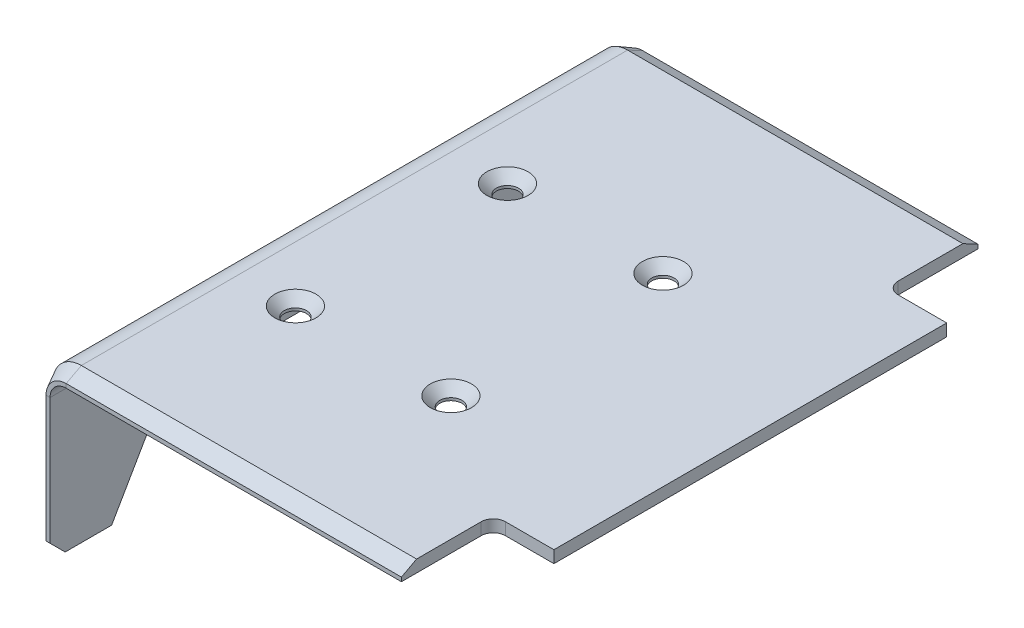
ISO-10303-21;
HEADER;
FILE_DESCRIPTION(('STEP AP214'),'2;1');
FILE_NAME('part.step','',(''),(''),'','','');
FILE_SCHEMA(('AUTOMOTIVE_DESIGN { 1 0 10303 214 1 1 1 1 }'));
ENDSEC;
DATA;
#1=APPLICATION_CONTEXT('core data for automotive mechanical design processes');
#2=APPLICATION_PROTOCOL_DEFINITION('international standard','automotive_design',2000,#1);
#3=PRODUCT_CONTEXT('',#1,'mechanical');
#4=PRODUCT('Part','Part','',(#3));
#5=PRODUCT_RELATED_PRODUCT_CATEGORY('part','',(#4));
#6=PRODUCT_DEFINITION_FORMATION('','',#4);
#7=PRODUCT_DEFINITION_CONTEXT('part definition',#1,'design');
#8=PRODUCT_DEFINITION('design','',#6,#7);
#9=PRODUCT_DEFINITION_SHAPE('','',#8);
#10=(LENGTH_UNIT() NAMED_UNIT(*) SI_UNIT(.MILLI.,.METRE.));
#11=(NAMED_UNIT(*) PLANE_ANGLE_UNIT() SI_UNIT($,.RADIAN.));
#12=(NAMED_UNIT(*) SI_UNIT($,.STERADIAN.) SOLID_ANGLE_UNIT());
#13=UNCERTAINTY_MEASURE_WITH_UNIT(LENGTH_MEASURE(1.E-05),#10,'distance_accuracy_value','');
#14=(GEOMETRIC_REPRESENTATION_CONTEXT(3) GLOBAL_UNCERTAINTY_ASSIGNED_CONTEXT((#13)) GLOBAL_UNIT_ASSIGNED_CONTEXT((#10,
#11,#12)) REPRESENTATION_CONTEXT('',''));
#15=CARTESIAN_POINT('',(0.,0.,0.));
#16=DIRECTION('',(0.,0.,1.));
#17=DIRECTION('',(1.,0.,0.));
#18=AXIS2_PLACEMENT_3D('',#15,#16,#17);
#19=CARTESIAN_POINT('',(-91.,70.,142.75));
#20=DIRECTION('',(0.,0.,-1.));
#21=DIRECTION('',(-1.,0.,0.));
#22=AXIS2_PLACEMENT_3D('',#19,#20,#21);
#23=CYLINDRICAL_SURFACE('',#22,14.);
#24=DIRECTION('',(0.,0.,-1.));
#25=VECTOR('',#24,1.);
#26=CARTESIAN_POINT('',(-91.,84.,142.75));
#27=LINE('',#26,#25);
#28=CARTESIAN_POINT('',(-90.9999999999998,84.,135.25));
#29=VERTEX_POINT('',#28);
#30=CARTESIAN_POINT('',(-90.9999999999998,84.,-135.25));
#31=VERTEX_POINT('',#30);
#32=EDGE_CURVE('E231',#29,#31,#27,.T.);
#33=ORIENTED_EDGE('',*,*,#32,.T.);
#34=CARTESIAN_POINT('',(-91.,70.,-135.25));
#35=DIRECTION('',(0.,0.,1.));
#36=DIRECTION('',(1.,0.,0.));
#37=AXIS2_PLACEMENT_3D('',#34,#35,#36);
#38=CIRCLE('',#37,14.);
#39=CARTESIAN_POINT('',(-105.,70.0000000000001,-135.25));
#40=VERTEX_POINT('',#39);
#41=EDGE_CURVE('E576',#31,#40,#38,.T.);
#42=ORIENTED_EDGE('',*,*,#41,.T.);
#43=DIRECTION('',(0.,0.,-1.));
#44=VECTOR('',#43,1.);
#45=CARTESIAN_POINT('',(-105.,69.9999999999999,142.75));
#46=LINE('',#45,#44);
#47=CARTESIAN_POINT('',(-105.,70.0000000000001,135.25));
#48=VERTEX_POINT('',#47);
#49=EDGE_CURVE('E238',#48,#40,#46,.T.);
#50=ORIENTED_EDGE('',*,*,#49,.F.);
#51=CARTESIAN_POINT('',(-91.,70.,135.25));
#52=DIRECTION('',(0.,0.,1.));
#53=DIRECTION('',(1.,0.,0.));
#54=AXIS2_PLACEMENT_3D('',#51,#52,#53);
#55=CIRCLE('',#54,14.);
#56=EDGE_CURVE('E473',#29,#48,#55,.T.);
#57=ORIENTED_EDGE('',*,*,#56,.F.);
#58=EDGE_LOOP('',(#33,#42,#50,#57));
#59=FACE_BOUND('',#58,.T.);
#60=ADVANCED_FACE('F36',(#59),#23,.T.);
#61=CARTESIAN_POINT('',(-105.,0.,142.75));
#62=DIRECTION('',(-1.,0.,0.));
#63=DIRECTION('',(0.,-1.,0.));
#64=AXIS2_PLACEMENT_3D('',#61,#62,#63);
#65=PLANE('',#64);
#66=DIRECTION('',(0.,-1.,0.));
#67=VECTOR('',#66,1.);
#68=CARTESIAN_POINT('',(-105.,70.0000000000001,-135.25));
#69=LINE('',#68,#67);
#70=CARTESIAN_POINT('',(-105.,-2.50000000000083,-135.25));
#71=VERTEX_POINT('',#70);
#72=EDGE_CURVE('E335',#40,#71,#69,.T.);
#73=ORIENTED_EDGE('',*,*,#72,.T.);
#74=DIRECTION('',(0.,0.,1.));
#75=VECTOR('',#74,1.);
#76=CARTESIAN_POINT('',(-105.,-2.5,-142.75));
#77=LINE('',#76,#75);
#78=CARTESIAN_POINT('',(-105.,-2.5,-104.193375672974));
#79=VERTEX_POINT('',#78);
#80=EDGE_CURVE('E276',#71,#79,#77,.T.);
#81=ORIENTED_EDGE('',*,*,#80,.T.);
#82=DIRECTION('',(0.,-0.866025403784436,-0.500000000000004));
#83=VECTOR('',#82,1.);
#84=CARTESIAN_POINT('',(-105.,0.,-102.75));
#85=LINE('',#84,#83);
#86=CARTESIAN_POINT('',(-105.,35.0000000000001,-82.5427405783628));
#87=VERTEX_POINT('',#86);
#88=EDGE_CURVE('E401',#87,#79,#85,.T.);
#89=ORIENTED_EDGE('',*,*,#88,.F.);
#90=CARTESIAN_POINT('',(-105.,25.,-65.2222325026741));
#91=DIRECTION('',(-1.,0.,0.));
#92=DIRECTION('',(0.,0.,-1.));
#93=AXIS2_PLACEMENT_3D('',#90,#91,#92);
#94=CIRCLE('',#93,20.);
#95=CARTESIAN_POINT('',(-105.,45.,-65.2222325026741));
#96=VERTEX_POINT('',#95);
#97=EDGE_CURVE('E415',#96,#87,#94,.T.);
#98=ORIENTED_EDGE('',*,*,#97,.F.);
#99=DIRECTION('',(0.,0.,-1.));
#100=VECTOR('',#99,1.);
#101=CARTESIAN_POINT('',(-105.,45.,-65.2222325026741));
#102=LINE('',#101,#100);
#103=CARTESIAN_POINT('',(-105.,45.,74.7222325026741));
#104=VERTEX_POINT('',#103);
#105=EDGE_CURVE('E408',#104,#96,#102,.T.);
#106=ORIENTED_EDGE('',*,*,#105,.F.);
#107=CARTESIAN_POINT('',(-105.,25.,74.7222325026741));
#108=DIRECTION('',(-1.,0.,0.));
#109=DIRECTION('',(0.,0.,1.));
#110=AXIS2_PLACEMENT_3D('',#107,#108,#109);
#111=CIRCLE('',#110,20.);
#112=CARTESIAN_POINT('',(-105.,35.0000000000001,92.0427405783628));
#113=VERTEX_POINT('',#112);
#114=EDGE_CURVE('E405',#113,#104,#111,.T.);
#115=ORIENTED_EDGE('',*,*,#114,.F.);
#116=DIRECTION('',(0.,0.866025403784436,-0.500000000000004));
#117=VECTOR('',#116,1.);
#118=CARTESIAN_POINT('',(-105.,35.0000000000001,92.0427405783628));
#119=LINE('',#118,#117);
#120=CARTESIAN_POINT('',(-105.,0.,112.25));
#121=VERTEX_POINT('',#120);
#122=EDGE_CURVE('E398',#121,#113,#119,.T.);
#123=ORIENTED_EDGE('',*,*,#122,.F.);
#124=DIRECTION('',(0.,0.,-1.));
#125=VECTOR('',#124,1.);
#126=CARTESIAN_POINT('',(-105.,0.,142.75));
#127=LINE('',#126,#125);
#128=CARTESIAN_POINT('',(-105.,1.94289029309402E-13,135.25));
#129=VERTEX_POINT('',#128);
#130=EDGE_CURVE('E383',#129,#121,#127,.T.);
#131=ORIENTED_EDGE('',*,*,#130,.F.);
#132=DIRECTION('',(0.,-1.,0.));
#133=VECTOR('',#132,1.);
#134=CARTESIAN_POINT('',(-105.,70.0000000000001,135.25));
#135=LINE('',#134,#133);
#136=EDGE_CURVE('E479',#48,#129,#135,.T.);
#137=ORIENTED_EDGE('',*,*,#136,.F.);
#138=ORIENTED_EDGE('',*,*,#49,.T.);
#139=EDGE_LOOP('',(#73,#81,#89,#98,#106,#115,#123,#131,#137,#138));
#140=FACE_BOUND('',#139,.T.);
#141=ADVANCED_FACE('F342',(#140),#65,.T.);
#142=CARTESIAN_POINT('',(-105.,69.9999999999999,-142.75));
#143=DIRECTION('',(0.,0.,-1.));
#144=DIRECTION('',(-1.,0.,0.));
#145=AXIS2_PLACEMENT_3D('',#142,#143,#144);
#146=PLANE('',#145);
#147=DIRECTION('',(1.,0.,0.));
#148=VECTOR('',#147,1.);
#149=CARTESIAN_POINT('',(-105.,69.9999999999999,-142.75));
#150=LINE('',#149,#148);
#151=CARTESIAN_POINT('',(-101.,70.0000000000001,-142.75));
#152=VERTEX_POINT('',#151);
#153=CARTESIAN_POINT('',(-99.,70.,-142.75));
#154=VERTEX_POINT('',#153);
#155=EDGE_CURVE('E244',#152,#154,#150,.T.);
#156=ORIENTED_EDGE('',*,*,#155,.F.);
#157=CARTESIAN_POINT('',(-91.,70.,-142.75));
#158=DIRECTION('',(0.,0.,1.));
#159=DIRECTION('',(1.,0.,0.));
#160=AXIS2_PLACEMENT_3D('',#157,#158,#159);
#161=CIRCLE('',#160,10.);
#162=CARTESIAN_POINT('',(-90.9999999999998,80.,-142.75));
#163=VERTEX_POINT('',#162);
#164=EDGE_CURVE('E531',#163,#152,#161,.T.);
#165=ORIENTED_EDGE('',*,*,#164,.F.);
#166=DIRECTION('',(0.,1.,0.));
#167=VECTOR('',#166,1.);
#168=CARTESIAN_POINT('',(-91.,78.,-142.75));
#169=LINE('',#168,#167);
#170=CARTESIAN_POINT('',(-91.,78.,-142.75));
#171=VERTEX_POINT('',#170);
#172=EDGE_CURVE('E234',#171,#163,#169,.T.);
#173=ORIENTED_EDGE('',*,*,#172,.F.);
#174=CARTESIAN_POINT('',(-91.,70.,-142.75));
#175=DIRECTION('',(0.,0.,1.));
#176=DIRECTION('',(1.,0.,0.));
#177=AXIS2_PLACEMENT_3D('',#174,#175,#176);
#178=CIRCLE('',#177,8.);
#179=EDGE_CURVE('E362',#154,#171,#178,.F.);
#180=ORIENTED_EDGE('',*,*,#179,.F.);
#181=EDGE_LOOP('',(#156,#165,#173,#180));
#182=FACE_BOUND('',#181,.T.);
#183=ADVANCED_FACE('F528',(#182),#146,.T.);
#184=CARTESIAN_POINT('',(-91.,78.,-142.75));
#185=DIRECTION('',(0.,0.,-1.));
#186=DIRECTION('',(-1.,0.,0.));
#187=AXIS2_PLACEMENT_3D('',#184,#185,#186);
#188=PLANE('',#187);
#189=DIRECTION('',(0.,1.,0.));
#190=VECTOR('',#189,1.);
#191=CARTESIAN_POINT('',(-99.,0.,-142.75));
#192=LINE('',#191,#190);
#193=CARTESIAN_POINT('',(-99.,5.00000000000006,-142.75));
#194=VERTEX_POINT('',#193);
#195=EDGE_CURVE('E359',#194,#154,#192,.T.);
#196=ORIENTED_EDGE('',*,*,#195,.F.);
#197=DIRECTION('',(-1.,0.,0.));
#198=VECTOR('',#197,1.);
#199=CARTESIAN_POINT('',(-91.,5.00000000000006,-142.75));
#200=LINE('',#199,#198);
#201=CARTESIAN_POINT('',(-101.,5.00000000000006,-142.75));
#202=VERTEX_POINT('',#201);
#203=EDGE_CURVE('E330',#194,#202,#200,.T.);
#204=ORIENTED_EDGE('',*,*,#203,.T.);
#205=DIRECTION('',(0.,-1.,0.));
#206=VECTOR('',#205,1.);
#207=CARTESIAN_POINT('',(-101.,70.0000000000001,-142.75));
#208=LINE('',#207,#206);
#209=EDGE_CURVE('E338',#152,#202,#208,.T.);
#210=ORIENTED_EDGE('',*,*,#209,.F.);
#211=ORIENTED_EDGE('',*,*,#155,.T.);
#212=EDGE_LOOP('',(#196,#204,#210,#211));
#213=FACE_BOUND('',#212,.T.);
#214=ADVANCED_FACE('F357',(#213),#188,.T.);
#215=CARTESIAN_POINT('',(-91.,84.,142.75));
#216=DIRECTION('',(0.,0.,1.));
#217=DIRECTION('',(1.,0.,0.));
#218=AXIS2_PLACEMENT_3D('',#215,#216,#217);
#219=PLANE('',#218);
#220=DIRECTION('',(0.,-1.,0.));
#221=VECTOR('',#220,1.);
#222=CARTESIAN_POINT('',(-91.,84.,142.75));
#223=LINE('',#222,#221);
#224=CARTESIAN_POINT('',(-90.9999999999998,80.,142.75));
#225=VERTEX_POINT('',#224);
#226=CARTESIAN_POINT('',(-91.,78.,142.75));
#227=VERTEX_POINT('',#226);
#228=EDGE_CURVE('E250',#225,#227,#223,.T.);
#229=ORIENTED_EDGE('',*,*,#228,.F.);
#230=CARTESIAN_POINT('',(-91.,70.,142.75));
#231=DIRECTION('',(0.,0.,1.));
#232=DIRECTION('',(1.,0.,0.));
#233=AXIS2_PLACEMENT_3D('',#230,#231,#232);
#234=CIRCLE('',#233,10.);
#235=CARTESIAN_POINT('',(-101.,70.0000000000001,142.75));
#236=VERTEX_POINT('',#235);
#237=EDGE_CURVE('E471',#225,#236,#234,.T.);
#238=ORIENTED_EDGE('',*,*,#237,.T.);
#239=DIRECTION('',(-1.,0.,0.));
#240=VECTOR('',#239,1.);
#241=CARTESIAN_POINT('',(-99.,70.,142.75));
#242=LINE('',#241,#240);
#243=CARTESIAN_POINT('',(-99.,70.,142.75));
#244=VERTEX_POINT('',#243);
#245=EDGE_CURVE('E247',#244,#236,#242,.T.);
#246=ORIENTED_EDGE('',*,*,#245,.F.);
#247=CARTESIAN_POINT('',(-91.,70.,142.75));
#248=DIRECTION('',(0.,0.,1.));
#249=DIRECTION('',(1.,0.,0.));
#250=AXIS2_PLACEMENT_3D('',#247,#248,#249);
#251=CIRCLE('',#250,8.);
#252=EDGE_CURVE('E379',#244,#227,#251,.F.);
#253=ORIENTED_EDGE('',*,*,#252,.T.);
#254=EDGE_LOOP('',(#229,#238,#246,#253));
#255=FACE_BOUND('',#254,.T.);
#256=ADVANCED_FACE('F439',(#255),#219,.T.);
#257=CARTESIAN_POINT('',(-99.,0.,142.75));
#258=DIRECTION('',(0.,-1.,0.));
#259=DIRECTION('',(1.,0.,0.));
#260=AXIS2_PLACEMENT_3D('',#257,#258,#259);
#261=PLANE('',#260);
#262=DIRECTION('',(0.,0.,-1.));
#263=VECTOR('',#262,1.);
#264=CARTESIAN_POINT('',(-99.,0.,142.75));
#265=LINE('',#264,#263);
#266=CARTESIAN_POINT('',(-99.,0.,135.25));
#267=VERTEX_POINT('',#266);
#268=CARTESIAN_POINT('',(-99.,0.,112.25));
#269=VERTEX_POINT('',#268);
#270=EDGE_CURVE('E381',#267,#269,#265,.T.);
#271=ORIENTED_EDGE('',*,*,#270,.F.);
#272=DIRECTION('',(-1.,0.,0.));
#273=VECTOR('',#272,1.);
#274=CARTESIAN_POINT('',(-99.,0.,135.25));
#275=LINE('',#274,#273);
#276=EDGE_CURVE('E320',#267,#129,#275,.T.);
#277=ORIENTED_EDGE('',*,*,#276,.T.);
#278=ORIENTED_EDGE('',*,*,#130,.T.);
#279=DIRECTION('',(-1.,0.,0.));
#280=VECTOR('',#279,1.);
#281=CARTESIAN_POINT('',(105.,0.,112.25));
#282=LINE('',#281,#280);
#283=EDGE_CURVE('E390',#269,#121,#282,.T.);
#284=ORIENTED_EDGE('',*,*,#283,.F.);
#285=EDGE_LOOP('',(#271,#277,#278,#284));
#286=FACE_BOUND('',#285,.T.);
#287=ADVANCED_FACE('F389',(#286),#261,.T.);
#288=CARTESIAN_POINT('',(-91.,70.,142.75));
#289=DIRECTION('',(0.,0.,1.));
#290=DIRECTION('',(1.,0.,0.));
#291=AXIS2_PLACEMENT_3D('',#288,#289,#290);
#292=PLANE('',#291);
#293=DIRECTION('',(0.,-1.,0.));
#294=VECTOR('',#293,1.);
#295=CARTESIAN_POINT('',(-101.,70.0000000000001,142.75));
#296=LINE('',#295,#294);
#297=CARTESIAN_POINT('',(-101.,7.50000000000001,142.75));
#298=VERTEX_POINT('',#297);
#299=EDGE_CURVE('E476',#236,#298,#296,.T.);
#300=ORIENTED_EDGE('',*,*,#299,.T.);
#301=DIRECTION('',(1.,0.,0.));
#302=VECTOR('',#301,1.);
#303=CARTESIAN_POINT('',(-91.,7.50000000000001,142.75));
#304=LINE('',#303,#302);
#305=CARTESIAN_POINT('',(-99.,7.50000000000001,142.75));
#306=VERTEX_POINT('',#305);
#307=EDGE_CURVE('E325',#298,#306,#304,.T.);
#308=ORIENTED_EDGE('',*,*,#307,.T.);
#309=DIRECTION('',(0.,1.,0.));
#310=VECTOR('',#309,1.);
#311=CARTESIAN_POINT('',(-99.,0.,142.75));
#312=LINE('',#311,#310);
#313=EDGE_CURVE('E432',#306,#244,#312,.T.);
#314=ORIENTED_EDGE('',*,*,#313,.T.);
#315=ORIENTED_EDGE('',*,*,#245,.T.);
#316=EDGE_LOOP('',(#300,#308,#314,#315));
#317=FACE_BOUND('',#316,.T.);
#318=ADVANCED_FACE('F526',(#317),#292,.T.);
#319=CARTESIAN_POINT('',(-99.,70.,142.75));
#320=DIRECTION('',(0.,0.,1.));
#321=DIRECTION('',(1.,0.,0.));
#322=AXIS2_PLACEMENT_3D('',#319,#320,#321);
#323=PLANE('',#322);
#324=DIRECTION('',(0.,1.,0.));
#325=VECTOR('',#324,1.);
#326=CARTESIAN_POINT('',(75.0000000000002,-2.50000000000082,142.75));
#327=LINE('',#326,#325);
#328=CARTESIAN_POINT('',(75.0000000000002,78.,142.75));
#329=VERTEX_POINT('',#328);
#330=CARTESIAN_POINT('',(75.0000000000002,80.,142.75));
#331=VERTEX_POINT('',#330);
#332=EDGE_CURVE('E214',#329,#331,#327,.T.);
#333=ORIENTED_EDGE('',*,*,#332,.T.);
#334=DIRECTION('',(1.,0.,0.));
#335=VECTOR('',#334,1.);
#336=CARTESIAN_POINT('',(-90.9999999999998,80.,142.75));
#337=LINE('',#336,#335);
#338=EDGE_CURVE('E456',#225,#331,#337,.T.);
#339=ORIENTED_EDGE('',*,*,#338,.F.);
#340=ORIENTED_EDGE('',*,*,#228,.T.);
#341=DIRECTION('',(1.,0.,0.));
#342=VECTOR('',#341,1.);
#343=CARTESIAN_POINT('',(-105.,78.,142.75));
#344=LINE('',#343,#342);
#345=EDGE_CURVE('E366',#227,#329,#344,.T.);
#346=ORIENTED_EDGE('',*,*,#345,.T.);
#347=EDGE_LOOP('',(#333,#339,#340,#346));
#348=FACE_BOUND('',#347,.T.);
#349=ADVANCED_FACE('F453',(#348),#323,.T.);
#350=CARTESIAN_POINT('',(-105.,78.,142.75));
#351=DIRECTION('',(0.,1.,0.));
#352=DIRECTION('',(0.,0.,1.));
#353=AXIS2_PLACEMENT_3D('',#350,#351,#352);
#354=PLANE('',#353);
#355=CARTESIAN_POINT('',(-63.5,78.,-48.25));
#356=DIRECTION('',(0.,1.,0.));
#357=DIRECTION('',(0.,0.,1.));
#358=AXIS2_PLACEMENT_3D('',#355,#356,#357);
#359=CIRCLE('',#358,5.49999999999998);
#360=CARTESIAN_POINT('',(-63.5,78.,-42.75));
#361=VERTEX_POINT('',#360);
#362=EDGE_CURVE('E290',#361,#361,#359,.T.);
#363=ORIENTED_EDGE('',*,*,#362,.T.);
#364=EDGE_LOOP('',(#363));
#365=FACE_BOUND('',#364,.T.);
#366=CARTESIAN_POINT('',(13.5,78.,-48.25));
#367=DIRECTION('',(0.,1.,0.));
#368=DIRECTION('',(0.,0.,1.));
#369=AXIS2_PLACEMENT_3D('',#366,#367,#368);
#370=CIRCLE('',#369,5.49999999999998);
#371=CARTESIAN_POINT('',(13.5,78.,-42.75));
#372=VERTEX_POINT('',#371);
#373=EDGE_CURVE('E284',#372,#372,#370,.T.);
#374=ORIENTED_EDGE('',*,*,#373,.T.);
#375=EDGE_LOOP('',(#374));
#376=FACE_BOUND('',#375,.T.);
#377=CARTESIAN_POINT('',(13.5,78.,56.75));
#378=DIRECTION('',(0.,1.,0.));
#379=DIRECTION('',(0.,0.,1.));
#380=AXIS2_PLACEMENT_3D('',#377,#378,#379);
#381=CIRCLE('',#380,5.49999999999998);
#382=CARTESIAN_POINT('',(13.5,78.,62.25));
#383=VERTEX_POINT('',#382);
#384=EDGE_CURVE('E278',#383,#383,#381,.T.);
#385=ORIENTED_EDGE('',*,*,#384,.T.);
#386=EDGE_LOOP('',(#385));
#387=FACE_BOUND('',#386,.T.);
#388=CARTESIAN_POINT('',(-63.5,78.,56.75));
#389=DIRECTION('',(0.,1.,0.));
#390=DIRECTION('',(0.,0.,1.));
#391=AXIS2_PLACEMENT_3D('',#388,#389,#390);
#392=CIRCLE('',#391,5.49999999999998);
#393=CARTESIAN_POINT('',(-63.5,78.,62.25));
#394=VERTEX_POINT('',#393);
#395=EDGE_CURVE('E272',#394,#394,#392,.T.);
#396=ORIENTED_EDGE('',*,*,#395,.T.);
#397=EDGE_LOOP('',(#396));
#398=FACE_BOUND('',#397,.T.);
#399=DIRECTION('',(-1.,0.,0.));
#400=VECTOR('',#399,1.);
#401=CARTESIAN_POINT('',(-105.,78.,97.25));
#402=LINE('',#401,#400);
#403=CARTESIAN_POINT('',(105.,78.,97.25));
#404=VERTEX_POINT('',#403);
#405=CARTESIAN_POINT('',(81.0000000000003,78.,97.25));
#406=VERTEX_POINT('',#405);
#407=EDGE_CURVE('E209',#404,#406,#402,.T.);
#408=ORIENTED_EDGE('',*,*,#407,.T.);
#409=CARTESIAN_POINT('',(81.0000000000003,78.,103.25));
#410=DIRECTION('',(0.,1.,0.));
#411=DIRECTION('',(0.,0.,1.));
#412=AXIS2_PLACEMENT_3D('',#409,#410,#411);
#413=CIRCLE('',#412,6.);
#414=CARTESIAN_POINT('',(75.0000000000003,78.,103.25));
#415=VERTEX_POINT('',#414);
#416=EDGE_CURVE('E317',#406,#415,#413,.T.);
#417=ORIENTED_EDGE('',*,*,#416,.T.);
#418=DIRECTION('',(0.,0.,1.));
#419=VECTOR('',#418,1.);
#420=CARTESIAN_POINT('',(75.0000000000003,78.,142.75));
#421=LINE('',#420,#419);
#422=EDGE_CURVE('E449',#415,#329,#421,.T.);
#423=ORIENTED_EDGE('',*,*,#422,.T.);
#424=ORIENTED_EDGE('',*,*,#345,.F.);
#425=DIRECTION('',(0.,0.,-1.));
#426=VECTOR('',#425,1.);
#427=CARTESIAN_POINT('',(-91.,78.,142.75));
#428=LINE('',#427,#426);
#429=EDGE_CURVE('E374',#227,#171,#428,.T.);
#430=ORIENTED_EDGE('',*,*,#429,.T.);
#431=DIRECTION('',(1.,0.,0.));
#432=VECTOR('',#431,1.);
#433=CARTESIAN_POINT('',(-105.,78.,-142.75));
#434=LINE('',#433,#432);
#435=CARTESIAN_POINT('',(75.0000000000002,78.,-142.75));
#436=VERTEX_POINT('',#435);
#437=EDGE_CURVE('E363',#171,#436,#434,.T.);
#438=ORIENTED_EDGE('',*,*,#437,.T.);
#439=DIRECTION('',(0.,0.,1.));
#440=VECTOR('',#439,1.);
#441=CARTESIAN_POINT('',(75.0000000000002,78.,142.75));
#442=LINE('',#441,#440);
#443=CARTESIAN_POINT('',(75.0000000000002,78.,-103.25));
#444=VERTEX_POINT('',#443);
#445=EDGE_CURVE('E539',#436,#444,#442,.T.);
#446=ORIENTED_EDGE('',*,*,#445,.T.);
#447=CARTESIAN_POINT('',(81.0000000000002,78.,-103.25));
#448=DIRECTION('',(0.,1.,0.));
#449=DIRECTION('',(0.,0.,1.));
#450=AXIS2_PLACEMENT_3D('',#447,#448,#449);
#451=CIRCLE('',#450,6.);
#452=CARTESIAN_POINT('',(81.0000000000002,78.,-97.25));
#453=VERTEX_POINT('',#452);
#454=EDGE_CURVE('E313',#444,#453,#451,.T.);
#455=ORIENTED_EDGE('',*,*,#454,.T.);
#456=DIRECTION('',(1.,0.,0.));
#457=VECTOR('',#456,1.);
#458=CARTESIAN_POINT('',(-105.,78.,-97.25));
#459=LINE('',#458,#457);
#460=CARTESIAN_POINT('',(105.,78.,-97.25));
#461=VERTEX_POINT('',#460);
#462=EDGE_CURVE('E544',#453,#461,#459,.T.);
#463=ORIENTED_EDGE('',*,*,#462,.T.);
#464=DIRECTION('',(0.,0.,-1.));
#465=VECTOR('',#464,1.);
#466=CARTESIAN_POINT('',(105.,78.,142.75));
#467=LINE('',#466,#465);
#468=EDGE_CURVE('E230',#404,#461,#467,.T.);
#469=ORIENTED_EDGE('',*,*,#468,.F.);
#470=EDGE_LOOP('',(#408,#417,#423,#424,#430,#438,#446,#455,#463,#469));
#471=FACE_BOUND('',#470,.T.);
#472=ADVANCED_FACE('F447',(#365,#376,#387,#398,#471),#354,.F.);
#473=CARTESIAN_POINT('',(105.,84.,142.75));
#474=DIRECTION('',(1.,0.,0.));
#475=DIRECTION('',(0.,1.,0.));
#476=AXIS2_PLACEMENT_3D('',#473,#474,#475);
#477=PLANE('',#476);
#478=DIRECTION('',(0.,1.,0.));
#479=VECTOR('',#478,1.);
#480=CARTESIAN_POINT('',(105.,-2.50000000000082,97.25));
#481=LINE('',#480,#479);
#482=CARTESIAN_POINT('',(105.,84.,97.25));
#483=VERTEX_POINT('',#482);
#484=EDGE_CURVE('E203',#404,#483,#481,.T.);
#485=ORIENTED_EDGE('',*,*,#484,.F.);
#486=ORIENTED_EDGE('',*,*,#468,.T.);
#487=DIRECTION('',(0.,1.,0.));
#488=VECTOR('',#487,1.);
#489=CARTESIAN_POINT('',(105.,-2.50000000000082,-97.25));
#490=LINE('',#489,#488);
#491=CARTESIAN_POINT('',(105.,84.,-97.25));
#492=VERTEX_POINT('',#491);
#493=EDGE_CURVE('E229',#461,#492,#490,.T.);
#494=ORIENTED_EDGE('',*,*,#493,.T.);
#495=DIRECTION('',(0.,0.,-1.));
#496=VECTOR('',#495,1.);
#497=CARTESIAN_POINT('',(105.,84.,142.75));
#498=LINE('',#497,#496);
#499=EDGE_CURVE('E223',#483,#492,#498,.T.);
#500=ORIENTED_EDGE('',*,*,#499,.F.);
#501=EDGE_LOOP('',(#485,#486,#494,#500));
#502=FACE_BOUND('',#501,.T.);
#503=ADVANCED_FACE('F227',(#502),#477,.T.);
#504=CARTESIAN_POINT('',(-105.,84.,142.75));
#505=DIRECTION('',(0.,1.,0.));
#506=DIRECTION('',(0.,0.,1.));
#507=AXIS2_PLACEMENT_3D('',#504,#505,#506);
#508=PLANE('',#507);
#509=DIRECTION('',(0.,0.,1.));
#510=VECTOR('',#509,1.);
#511=CARTESIAN_POINT('',(75.0000000000002,84.,142.75));
#512=LINE('',#511,#510);
#513=CARTESIAN_POINT('',(75.0000000000002,84.,103.25));
#514=VERTEX_POINT('',#513);
#515=CARTESIAN_POINT('',(75.0000000000002,84.,135.25));
#516=VERTEX_POINT('',#515);
#517=EDGE_CURVE('E215',#514,#516,#512,.T.);
#518=ORIENTED_EDGE('',*,*,#517,.F.);
#519=CARTESIAN_POINT('',(81.0000000000003,84.,103.25));
#520=DIRECTION('',(0.,1.,0.));
#521=DIRECTION('',(0.,0.,1.));
#522=AXIS2_PLACEMENT_3D('',#519,#520,#521);
#523=CIRCLE('',#522,6.);
#524=CARTESIAN_POINT('',(81.0000000000003,84.,97.25));
#525=VERTEX_POINT('',#524);
#526=EDGE_CURVE('E225',#514,#525,#523,.F.);
#527=ORIENTED_EDGE('',*,*,#526,.T.);
#528=DIRECTION('',(-1.,0.,0.));
#529=VECTOR('',#528,1.);
#530=CARTESIAN_POINT('',(105.,84.,97.25));
#531=LINE('',#530,#529);
#532=EDGE_CURVE('E206',#483,#525,#531,.T.);
#533=ORIENTED_EDGE('',*,*,#532,.F.);
#534=ORIENTED_EDGE('',*,*,#499,.T.);
#535=DIRECTION('',(1.,0.,0.));
#536=VECTOR('',#535,1.);
#537=CARTESIAN_POINT('',(75.0000000000002,84.,-97.25));
#538=LINE('',#537,#536);
#539=CARTESIAN_POINT('',(81.0000000000002,84.,-97.25));
#540=VERTEX_POINT('',#539);
#541=EDGE_CURVE('E552',#540,#492,#538,.T.);
#542=ORIENTED_EDGE('',*,*,#541,.F.);
#543=CARTESIAN_POINT('',(81.0000000000002,84.,-103.25));
#544=DIRECTION('',(0.,1.,0.));
#545=DIRECTION('',(0.,0.,1.));
#546=AXIS2_PLACEMENT_3D('',#543,#544,#545);
#547=CIRCLE('',#546,6.);
#548=CARTESIAN_POINT('',(75.0000000000002,84.,-103.25));
#549=VERTEX_POINT('',#548);
#550=EDGE_CURVE('E311',#540,#549,#547,.F.);
#551=ORIENTED_EDGE('',*,*,#550,.T.);
#552=DIRECTION('',(0.,0.,1.));
#553=VECTOR('',#552,1.);
#554=CARTESIAN_POINT('',(75.0000000000002,84.,-142.75));
#555=LINE('',#554,#553);
#556=CARTESIAN_POINT('',(75.0000000000002,84.,-135.25));
#557=VERTEX_POINT('',#556);
#558=EDGE_CURVE('E555',#557,#549,#555,.T.);
#559=ORIENTED_EDGE('',*,*,#558,.F.);
#560=DIRECTION('',(1.,0.,0.));
#561=VECTOR('',#560,1.);
#562=CARTESIAN_POINT('',(-90.9999999999998,84.,-135.25));
#563=LINE('',#562,#561);
#564=EDGE_CURVE('E569',#31,#557,#563,.T.);
#565=ORIENTED_EDGE('',*,*,#564,.F.);
#566=ORIENTED_EDGE('',*,*,#32,.F.);
#567=DIRECTION('',(1.,0.,0.));
#568=VECTOR('',#567,1.);
#569=CARTESIAN_POINT('',(-90.9999999999998,84.,135.25));
#570=LINE('',#569,#568);
#571=EDGE_CURVE('E460',#29,#516,#570,.T.);
#572=ORIENTED_EDGE('',*,*,#571,.T.);
#573=EDGE_LOOP('',(#518,#527,#533,#534,#542,#551,#559,#565,#566,#572));
#574=FACE_BOUND('',#573,.T.);
#575=CARTESIAN_POINT('',(-63.5,84.,-48.25));
#576=DIRECTION('',(0.,1.,0.));
#577=DIRECTION('',(0.,0.,1.));
#578=AXIS2_PLACEMENT_3D('',#575,#576,#577);
#579=CIRCLE('',#578,10.2);
#580=CARTESIAN_POINT('',(-63.5,84.,-38.05));
#581=VERTEX_POINT('',#580);
#582=EDGE_CURVE('E481',#581,#581,#579,.T.);
#583=ORIENTED_EDGE('',*,*,#582,.F.);
#584=EDGE_LOOP('',(#583));
#585=FACE_BOUND('',#584,.T.);
#586=CARTESIAN_POINT('',(13.5,84.,-48.25));
#587=DIRECTION('',(0.,1.,0.));
#588=DIRECTION('',(0.,0.,1.));
#589=AXIS2_PLACEMENT_3D('',#586,#587,#588);
#590=CIRCLE('',#589,10.2);
#591=CARTESIAN_POINT('',(13.5,84.,-38.05));
#592=VERTEX_POINT('',#591);
#593=EDGE_CURVE('E294',#592,#592,#590,.T.);
#594=ORIENTED_EDGE('',*,*,#593,.F.);
#595=EDGE_LOOP('',(#594));
#596=FACE_BOUND('',#595,.T.);
#597=CARTESIAN_POINT('',(13.5,84.,56.75));
#598=DIRECTION('',(0.,1.,0.));
#599=DIRECTION('',(0.,0.,1.));
#600=AXIS2_PLACEMENT_3D('',#597,#598,#599);
#601=CIRCLE('',#600,10.2);
#602=CARTESIAN_POINT('',(13.5,84.,66.95));
#603=VERTEX_POINT('',#602);
#604=EDGE_CURVE('E288',#603,#603,#601,.T.);
#605=ORIENTED_EDGE('',*,*,#604,.F.);
#606=EDGE_LOOP('',(#605));
#607=FACE_BOUND('',#606,.T.);
#608=CARTESIAN_POINT('',(-63.5,84.,56.75));
#609=DIRECTION('',(0.,1.,0.));
#610=DIRECTION('',(0.,0.,1.));
#611=AXIS2_PLACEMENT_3D('',#608,#609,#610);
#612=CIRCLE('',#611,10.2);
#613=CARTESIAN_POINT('',(-63.5,84.,66.95));
#614=VERTEX_POINT('',#613);
#615=EDGE_CURVE('E282',#614,#614,#612,.T.);
#616=ORIENTED_EDGE('',*,*,#615,.F.);
#617=EDGE_LOOP('',(#616));
#618=FACE_BOUND('',#617,.T.);
#619=ADVANCED_FACE('F220',(#574,#585,#596,#607,#618),#508,.T.);
#620=CARTESIAN_POINT('',(-99.,0.,142.75));
#621=DIRECTION('',(-1.,0.,0.));
#622=DIRECTION('',(0.,-1.,0.));
#623=AXIS2_PLACEMENT_3D('',#620,#621,#622);
#624=PLANE('',#623);
#625=ORIENTED_EDGE('',*,*,#313,.F.);
#626=DIRECTION('',(0.,0.70710678118655,0.707106781186545));
#627=VECTOR('',#626,1.);
#628=CARTESIAN_POINT('',(-99.,0.,135.25));
#629=LINE('',#628,#627);
#630=EDGE_CURVE('E328',#306,#267,#629,.F.);
#631=ORIENTED_EDGE('',*,*,#630,.T.);
#632=ORIENTED_EDGE('',*,*,#270,.T.);
#633=DIRECTION('',(0.,0.866025403784436,-0.500000000000004));
#634=VECTOR('',#633,1.);
#635=CARTESIAN_POINT('',(-99.,-13.2068874077128,119.875));
#636=LINE('',#635,#634);
#637=CARTESIAN_POINT('',(-99.,35.0000000000001,92.0427405783628));
#638=VERTEX_POINT('',#637);
#639=EDGE_CURVE('E252',#269,#638,#636,.T.);
#640=ORIENTED_EDGE('',*,*,#639,.T.);
#641=CARTESIAN_POINT('',(-99.,25.,74.7222325026741));
#642=DIRECTION('',(-1.,0.,0.));
#643=DIRECTION('',(0.,-1.,0.));
#644=AXIS2_PLACEMENT_3D('',#641,#642,#643);
#645=CIRCLE('',#644,20.);
#646=CARTESIAN_POINT('',(-99.,45.,74.7222325026741));
#647=VERTEX_POINT('',#646);
#648=EDGE_CURVE('E256',#638,#647,#645,.T.);
#649=ORIENTED_EDGE('',*,*,#648,.T.);
#650=DIRECTION('',(0.,0.,-1.));
#651=VECTOR('',#650,1.);
#652=CARTESIAN_POINT('',(-99.,45.,142.75));
#653=LINE('',#652,#651);
#654=CARTESIAN_POINT('',(-99.,45.,-65.2222325026741));
#655=VERTEX_POINT('',#654);
#656=EDGE_CURVE('E259',#647,#655,#653,.T.);
#657=ORIENTED_EDGE('',*,*,#656,.T.);
#658=CARTESIAN_POINT('',(-99.,25.,-65.2222325026741));
#659=DIRECTION('',(-1.,0.,0.));
#660=DIRECTION('',(0.,-1.,0.));
#661=AXIS2_PLACEMENT_3D('',#658,#659,#660);
#662=CIRCLE('',#661,20.);
#663=CARTESIAN_POINT('',(-99.,35.0000000000001,-82.5427405783628));
#664=VERTEX_POINT('',#663);
#665=EDGE_CURVE('E263',#655,#664,#662,.T.);
#666=ORIENTED_EDGE('',*,*,#665,.T.);
#667=DIRECTION('',(0.,-0.866025403784436,-0.500000000000004));
#668=VECTOR('',#667,1.);
#669=CARTESIAN_POINT('',(-99.,106.30461831454,-41.374999999999));
#670=LINE('',#669,#668);
#671=CARTESIAN_POINT('',(-99.,-2.5,-104.193375672974));
#672=VERTEX_POINT('',#671);
#673=EDGE_CURVE('E267',#664,#672,#670,.T.);
#674=ORIENTED_EDGE('',*,*,#673,.T.);
#675=DIRECTION('',(0.,0.,1.));
#676=VECTOR('',#675,1.);
#677=CARTESIAN_POINT('',(-99.,-2.5,-142.75));
#678=LINE('',#677,#676);
#679=CARTESIAN_POINT('',(-99.,-2.5,-135.25));
#680=VERTEX_POINT('',#679);
#681=EDGE_CURVE('E354',#680,#672,#678,.T.);
#682=ORIENTED_EDGE('',*,*,#681,.F.);
#683=DIRECTION('',(0.,-0.707106781186547,0.707106781186548));
#684=VECTOR('',#683,1.);
#685=CARTESIAN_POINT('',(-99.,5.00000000000006,-142.75));
#686=LINE('',#685,#684);
#687=EDGE_CURVE('E58',#680,#194,#686,.F.);
#688=ORIENTED_EDGE('',*,*,#687,.T.);
#689=ORIENTED_EDGE('',*,*,#195,.T.);
#690=DIRECTION('',(0.,0.,-1.));
#691=VECTOR('',#690,1.);
#692=CARTESIAN_POINT('',(-99.,70.,142.75));
#693=LINE('',#692,#691);
#694=EDGE_CURVE('E378',#244,#154,#693,.T.);
#695=ORIENTED_EDGE('',*,*,#694,.F.);
#696=EDGE_LOOP('',(#625,#631,#632,#640,#649,#657,#666,#674,#682,#688,#689,#695));
#697=FACE_BOUND('',#696,.T.);
#698=ADVANCED_FACE('F504',(#697),#624,.F.);
#699=CARTESIAN_POINT('',(-91.,70.,142.75));
#700=DIRECTION('',(0.,0.,-1.));
#701=DIRECTION('',(-1.,0.,0.));
#702=AXIS2_PLACEMENT_3D('',#699,#700,#701);
#703=CYLINDRICAL_SURFACE('',#702,8.);
#704=ORIENTED_EDGE('',*,*,#179,.T.);
#705=ORIENTED_EDGE('',*,*,#429,.F.);
#706=ORIENTED_EDGE('',*,*,#252,.F.);
#707=ORIENTED_EDGE('',*,*,#694,.T.);
#708=EDGE_LOOP('',(#704,#705,#706,#707));
#709=FACE_BOUND('',#708,.T.);
#710=ADVANCED_FACE('F443',(#709),#703,.F.);
#711=CARTESIAN_POINT('',(-91.,70.,-142.75));
#712=DIRECTION('',(0.,0.,1.));
#713=DIRECTION('',(1.,0.,0.));
#714=AXIS2_PLACEMENT_3D('',#711,#712,#713);
#715=PLANE('',#714);
#716=DIRECTION('',(1.,0.,0.));
#717=VECTOR('',#716,1.);
#718=CARTESIAN_POINT('',(-90.9999999999998,80.,-142.75));
#719=LINE('',#718,#717);
#720=CARTESIAN_POINT('',(75.0000000000002,80.,-142.75));
#721=VERTEX_POINT('',#720);
#722=EDGE_CURVE('E536',#163,#721,#719,.T.);
#723=ORIENTED_EDGE('',*,*,#722,.T.);
#724=DIRECTION('',(0.,1.,0.));
#725=VECTOR('',#724,1.);
#726=CARTESIAN_POINT('',(75.0000000000002,-2.50000000000082,-142.75));
#727=LINE('',#726,#725);
#728=EDGE_CURVE('E537',#436,#721,#727,.T.);
#729=ORIENTED_EDGE('',*,*,#728,.F.);
#730=ORIENTED_EDGE('',*,*,#437,.F.);
#731=ORIENTED_EDGE('',*,*,#172,.T.);
#732=EDGE_LOOP('',(#723,#729,#730,#731));
#733=FACE_BOUND('',#732,.T.);
#734=ADVANCED_FACE('F534',(#733),#715,.F.);
#735=CARTESIAN_POINT('',(105.,0.,-102.75));
#736=DIRECTION('',(0.,0.500000000000004,-0.866025403784436));
#737=DIRECTION('',(0.,0.866025403784436,0.500000000000004));
#738=AXIS2_PLACEMENT_3D('',#735,#736,#737);
#739=PLANE('',#738);
#740=DIRECTION('',(-1.,0.,0.));
#741=VECTOR('',#740,1.);
#742=CARTESIAN_POINT('',(105.,35.0000000000001,-82.5427405783628));
#743=LINE('',#742,#741);
#744=EDGE_CURVE('E370',#664,#87,#743,.T.);
#745=ORIENTED_EDGE('',*,*,#744,.T.);
#746=ORIENTED_EDGE('',*,*,#88,.T.);
#747=DIRECTION('',(-1.,0.,0.));
#748=VECTOR('',#747,1.);
#749=CARTESIAN_POINT('',(-99.,-2.5,-104.193375672974));
#750=LINE('',#749,#748);
#751=EDGE_CURVE('E353',#672,#79,#750,.T.);
#752=ORIENTED_EDGE('',*,*,#751,.F.);
#753=ORIENTED_EDGE('',*,*,#673,.F.);
#754=EDGE_LOOP('',(#745,#746,#752,#753));
#755=FACE_BOUND('',#754,.T.);
#756=ADVANCED_FACE('F507',(#755),#739,.F.);
#757=CARTESIAN_POINT('',(105.,25.,-65.2222325026741));
#758=DIRECTION('',(-1.,0.,0.));
#759=DIRECTION('',(0.,0.,1.));
#760=AXIS2_PLACEMENT_3D('',#757,#758,#759);
#761=CYLINDRICAL_SURFACE('',#760,20.);
#762=DIRECTION('',(-1.,0.,0.));
#763=VECTOR('',#762,1.);
#764=CARTESIAN_POINT('',(105.,45.,-65.2222325026741));
#765=LINE('',#764,#763);
#766=EDGE_CURVE('E423',#655,#96,#765,.T.);
#767=ORIENTED_EDGE('',*,*,#766,.T.);
#768=ORIENTED_EDGE('',*,*,#97,.T.);
#769=ORIENTED_EDGE('',*,*,#744,.F.);
#770=ORIENTED_EDGE('',*,*,#665,.F.);
#771=EDGE_LOOP('',(#767,#768,#769,#770));
#772=FACE_BOUND('',#771,.T.);
#773=ADVANCED_FACE('F510',(#772),#761,.F.);
#774=CARTESIAN_POINT('',(105.,45.,-65.2222325026741));
#775=DIRECTION('',(0.,1.,0.));
#776=DIRECTION('',(0.,0.,1.));
#777=AXIS2_PLACEMENT_3D('',#774,#775,#776);
#778=PLANE('',#777);
#779=DIRECTION('',(-1.,0.,0.));
#780=VECTOR('',#779,1.);
#781=CARTESIAN_POINT('',(105.,45.,74.7222325026741));
#782=LINE('',#781,#780);
#783=EDGE_CURVE('E426',#647,#104,#782,.T.);
#784=ORIENTED_EDGE('',*,*,#783,.T.);
#785=ORIENTED_EDGE('',*,*,#105,.T.);
#786=ORIENTED_EDGE('',*,*,#766,.F.);
#787=ORIENTED_EDGE('',*,*,#656,.F.);
#788=EDGE_LOOP('',(#784,#785,#786,#787));
#789=FACE_BOUND('',#788,.T.);
#790=ADVANCED_FACE('F513',(#789),#778,.F.);
#791=CARTESIAN_POINT('',(105.,25.,74.7222325026741));
#792=DIRECTION('',(-1.,0.,0.));
#793=DIRECTION('',(0.,0.,1.));
#794=AXIS2_PLACEMENT_3D('',#791,#792,#793);
#795=CYLINDRICAL_SURFACE('',#794,20.);
#796=DIRECTION('',(-1.,0.,0.));
#797=VECTOR('',#796,1.);
#798=CARTESIAN_POINT('',(105.,35.0000000000001,92.0427405783628));
#799=LINE('',#798,#797);
#800=EDGE_CURVE('E400',#638,#113,#799,.T.);
#801=ORIENTED_EDGE('',*,*,#800,.T.);
#802=ORIENTED_EDGE('',*,*,#114,.T.);
#803=ORIENTED_EDGE('',*,*,#783,.F.);
#804=ORIENTED_EDGE('',*,*,#648,.F.);
#805=EDGE_LOOP('',(#801,#802,#803,#804));
#806=FACE_BOUND('',#805,.T.);
#807=ADVANCED_FACE('F517',(#806),#795,.F.);
#808=CARTESIAN_POINT('',(105.,35.0000000000001,92.0427405783628));
#809=DIRECTION('',(0.,0.500000000000004,0.866025403784436));
#810=DIRECTION('',(0.,-0.866025403784436,0.500000000000004));
#811=AXIS2_PLACEMENT_3D('',#808,#809,#810);
#812=PLANE('',#811);
#813=ORIENTED_EDGE('',*,*,#283,.T.);
#814=ORIENTED_EDGE('',*,*,#122,.T.);
#815=ORIENTED_EDGE('',*,*,#800,.F.);
#816=ORIENTED_EDGE('',*,*,#639,.F.);
#817=EDGE_LOOP('',(#813,#814,#815,#816));
#818=FACE_BOUND('',#817,.T.);
#819=ADVANCED_FACE('F397',(#818),#812,.F.);
#820=CARTESIAN_POINT('',(-99.,-2.5,-142.75));
#821=DIRECTION('',(0.,-1.,0.));
#822=DIRECTION('',(1.,0.,0.));
#823=AXIS2_PLACEMENT_3D('',#820,#821,#822);
#824=PLANE('',#823);
#825=ORIENTED_EDGE('',*,*,#80,.F.);
#826=DIRECTION('',(1.,0.,0.));
#827=VECTOR('',#826,1.);
#828=CARTESIAN_POINT('',(-99.,-2.5,-135.25));
#829=LINE('',#828,#827);
#830=EDGE_CURVE('E11',#71,#680,#829,.T.);
#831=ORIENTED_EDGE('',*,*,#830,.T.);
#832=ORIENTED_EDGE('',*,*,#681,.T.);
#833=ORIENTED_EDGE('',*,*,#751,.T.);
#834=EDGE_LOOP('',(#825,#831,#832,#833));
#835=FACE_BOUND('',#834,.T.);
#836=ADVANCED_FACE('F351',(#835),#824,.T.);
#837=CARTESIAN_POINT('',(-63.5,84.,56.75));
#838=DIRECTION('',(0.,1.,0.));
#839=DIRECTION('',(0.,0.,1.));
#840=AXIS2_PLACEMENT_3D('',#837,#838,#839);
#841=CYLINDRICAL_SURFACE('',#840,5.49999999999998);
#842=CARTESIAN_POINT('',(-63.5,79.3,56.75));
#843=DIRECTION('',(0.,1.,0.));
#844=DIRECTION('',(0.,0.,1.));
#845=AXIS2_PLACEMENT_3D('',#842,#843,#844);
#846=CIRCLE('',#845,5.49999999999999);
#847=CARTESIAN_POINT('',(-63.5,79.3,62.25));
#848=VERTEX_POINT('',#847);
#849=EDGE_CURVE('E277',#848,#848,#846,.T.);
#850=ORIENTED_EDGE('',*,*,#849,.T.);
#851=EDGE_LOOP('',(#850));
#852=FACE_BOUND('',#851,.T.);
#853=ORIENTED_EDGE('',*,*,#395,.F.);
#854=EDGE_LOOP('',(#853));
#855=FACE_BOUND('',#854,.T.);
#856=ADVANCED_FACE('F677',(#852,#855),#841,.F.);
#857=CARTESIAN_POINT('',(-63.5,84.,56.75));
#858=DIRECTION('',(0.,1.,0.));
#859=DIRECTION('',(0.,0.,1.));
#860=AXIS2_PLACEMENT_3D('',#857,#858,#859);
#861=CONICAL_SURFACE('',#860,10.2,0.785398163397448);
#862=ORIENTED_EDGE('',*,*,#849,.F.);
#863=EDGE_LOOP('',(#862));
#864=FACE_BOUND('',#863,.T.);
#865=ORIENTED_EDGE('',*,*,#615,.T.);
#866=EDGE_LOOP('',(#865));
#867=FACE_BOUND('',#866,.T.);
#868=ADVANCED_FACE('F910',(#864,#867),#861,.F.);
#869=CARTESIAN_POINT('',(13.5,84.,56.75));
#870=DIRECTION('',(0.,1.,0.));
#871=DIRECTION('',(0.,0.,1.));
#872=AXIS2_PLACEMENT_3D('',#869,#870,#871);
#873=CYLINDRICAL_SURFACE('',#872,5.49999999999998);
#874=CARTESIAN_POINT('',(13.5,79.3,56.75));
#875=DIRECTION('',(0.,1.,0.));
#876=DIRECTION('',(0.,0.,1.));
#877=AXIS2_PLACEMENT_3D('',#874,#875,#876);
#878=CIRCLE('',#877,5.49999999999999);
#879=CARTESIAN_POINT('',(13.5,79.3,62.25));
#880=VERTEX_POINT('',#879);
#881=EDGE_CURVE('E283',#880,#880,#878,.T.);
#882=ORIENTED_EDGE('',*,*,#881,.T.);
#883=EDGE_LOOP('',(#882));
#884=FACE_BOUND('',#883,.T.);
#885=ORIENTED_EDGE('',*,*,#384,.F.);
#886=EDGE_LOOP('',(#885));
#887=FACE_BOUND('',#886,.T.);
#888=ADVANCED_FACE('F899',(#884,#887),#873,.F.);
#889=CARTESIAN_POINT('',(13.5,84.,56.75));
#890=DIRECTION('',(0.,1.,0.));
#891=DIRECTION('',(0.,0.,1.));
#892=AXIS2_PLACEMENT_3D('',#889,#890,#891);
#893=CONICAL_SURFACE('',#892,10.2,0.785398163397449);
#894=ORIENTED_EDGE('',*,*,#881,.F.);
#895=EDGE_LOOP('',(#894));
#896=FACE_BOUND('',#895,.T.);
#897=ORIENTED_EDGE('',*,*,#604,.T.);
#898=EDGE_LOOP('',(#897));
#899=FACE_BOUND('',#898,.T.);
#900=ADVANCED_FACE('F888',(#896,#899),#893,.F.);
#901=CARTESIAN_POINT('',(13.5,84.,-48.25));
#902=DIRECTION('',(0.,1.,0.));
#903=DIRECTION('',(0.,0.,1.));
#904=AXIS2_PLACEMENT_3D('',#901,#902,#903);
#905=CYLINDRICAL_SURFACE('',#904,5.49999999999998);
#906=CARTESIAN_POINT('',(13.5,79.3,-48.25));
#907=DIRECTION('',(0.,1.,0.));
#908=DIRECTION('',(0.,0.,1.));
#909=AXIS2_PLACEMENT_3D('',#906,#907,#908);
#910=CIRCLE('',#909,5.49999999999999);
#911=CARTESIAN_POINT('',(13.5,79.3,-42.75));
#912=VERTEX_POINT('',#911);
#913=EDGE_CURVE('E289',#912,#912,#910,.T.);
#914=ORIENTED_EDGE('',*,*,#913,.T.);
#915=EDGE_LOOP('',(#914));
#916=FACE_BOUND('',#915,.T.);
#917=ORIENTED_EDGE('',*,*,#373,.F.);
#918=EDGE_LOOP('',(#917));
#919=FACE_BOUND('',#918,.T.);
#920=ADVANCED_FACE('F877',(#916,#919),#905,.F.);
#921=CARTESIAN_POINT('',(13.5,84.,-48.25));
#922=DIRECTION('',(0.,1.,0.));
#923=DIRECTION('',(0.,0.,1.));
#924=AXIS2_PLACEMENT_3D('',#921,#922,#923);
#925=CONICAL_SURFACE('',#924,10.2,0.785398163397449);
#926=ORIENTED_EDGE('',*,*,#913,.F.);
#927=EDGE_LOOP('',(#926));
#928=FACE_BOUND('',#927,.T.);
#929=ORIENTED_EDGE('',*,*,#593,.T.);
#930=EDGE_LOOP('',(#929));
#931=FACE_BOUND('',#930,.T.);
#932=ADVANCED_FACE('F866',(#928,#931),#925,.F.);
#933=CARTESIAN_POINT('',(-63.5,84.,-48.25));
#934=DIRECTION('',(0.,1.,0.));
#935=DIRECTION('',(0.,0.,1.));
#936=AXIS2_PLACEMENT_3D('',#933,#934,#935);
#937=CYLINDRICAL_SURFACE('',#936,5.49999999999998);
#938=CARTESIAN_POINT('',(-63.5,79.3,-48.25));
#939=DIRECTION('',(0.,1.,0.));
#940=DIRECTION('',(0.,0.,1.));
#941=AXIS2_PLACEMENT_3D('',#938,#939,#940);
#942=CIRCLE('',#941,5.49999999999999);
#943=CARTESIAN_POINT('',(-63.5,79.3,-42.75));
#944=VERTEX_POINT('',#943);
#945=EDGE_CURVE('E295',#944,#944,#942,.T.);
#946=ORIENTED_EDGE('',*,*,#945,.T.);
#947=EDGE_LOOP('',(#946));
#948=FACE_BOUND('',#947,.T.);
#949=ORIENTED_EDGE('',*,*,#362,.F.);
#950=EDGE_LOOP('',(#949));
#951=FACE_BOUND('',#950,.T.);
#952=ADVANCED_FACE('F855',(#948,#951),#937,.F.);
#953=CARTESIAN_POINT('',(-63.5,84.,-48.25));
#954=DIRECTION('',(0.,1.,0.));
#955=DIRECTION('',(0.,0.,1.));
#956=AXIS2_PLACEMENT_3D('',#953,#954,#955);
#957=CONICAL_SURFACE('',#956,10.2,0.785398163397448);
#958=ORIENTED_EDGE('',*,*,#945,.F.);
#959=EDGE_LOOP('',(#958));
#960=FACE_BOUND('',#959,.T.);
#961=ORIENTED_EDGE('',*,*,#582,.T.);
#962=EDGE_LOOP('',(#961));
#963=FACE_BOUND('',#962,.T.);
#964=ADVANCED_FACE('F664',(#960,#963),#957,.F.);
#965=CARTESIAN_POINT('',(-101.,70.0000000000001,142.75));
#966=DIRECTION('',(-0.88235294117647,0.,0.470588235294119));
#967=DIRECTION('',(0.470588235294119,0.,0.88235294117647));
#968=AXIS2_PLACEMENT_3D('',#965,#966,#967);
#969=PLANE('',#968);
#970=ORIENTED_EDGE('',*,*,#136,.T.);
#971=DIRECTION('',(-0.352864873112985,-0.661621637086849,-0.661621637086844));
#972=VECTOR('',#971,1.);
#973=CARTESIAN_POINT('',(-86.408560311284,34.8589494163427,170.108949416342));
#974=LINE('',#973,#972);
#975=EDGE_CURVE('E323',#129,#298,#974,.F.);
#976=ORIENTED_EDGE('',*,*,#975,.T.);
#977=ORIENTED_EDGE('',*,*,#299,.F.);
#978=DIRECTION('',(-0.470588235294119,0.,-0.88235294117647));
#979=VECTOR('',#978,1.);
#980=CARTESIAN_POINT('',(-101.,70.0000000000001,142.75));
#981=LINE('',#980,#979);
#982=EDGE_CURVE('E465',#236,#48,#981,.T.);
#983=ORIENTED_EDGE('',*,*,#982,.T.);
#984=EDGE_LOOP('',(#970,#976,#977,#983));
#985=FACE_BOUND('',#984,.T.);
#986=ADVANCED_FACE('F523',(#985),#969,.T.);
#987=CARTESIAN_POINT('',(-91.,70.,142.75));
#988=DIRECTION('',(0.,0.,-1.));
#989=DIRECTION('',(-1.,0.,0.));
#990=AXIS2_PLACEMENT_3D('',#987,#988,#989);
#991=CONICAL_SURFACE('',#990,10.,0.48995732625373);
#992=DIRECTION('',(0.,0.470588235294119,-0.88235294117647));
#993=VECTOR('',#992,1.);
#994=CARTESIAN_POINT('',(-90.9999999999998,80.,142.75));
#995=LINE('',#994,#993);
#996=EDGE_CURVE('E347',#225,#29,#995,.T.);
#997=ORIENTED_EDGE('',*,*,#996,.T.);
#998=ORIENTED_EDGE('',*,*,#56,.T.);
#999=ORIENTED_EDGE('',*,*,#982,.F.);
#1000=ORIENTED_EDGE('',*,*,#237,.F.);
#1001=EDGE_LOOP('',(#997,#998,#999,#1000));
#1002=FACE_BOUND('',#1001,.T.);
#1003=ADVANCED_FACE('F663',(#1002),#991,.T.);
#1004=CARTESIAN_POINT('',(-90.9999999999998,80.,142.75));
#1005=DIRECTION('',(0.,-0.88235294117647,-0.470588235294119));
#1006=DIRECTION('',(0.,0.470588235294119,-0.88235294117647));
#1007=AXIS2_PLACEMENT_3D('',#1004,#1005,#1006);
#1008=PLANE('',#1007);
#1009=ORIENTED_EDGE('',*,*,#338,.T.);
#1010=DIRECTION('',(0.,0.470588235294119,-0.88235294117647));
#1011=VECTOR('',#1010,1.);
#1012=CARTESIAN_POINT('',(75.0000000000002,80.,142.75));
#1013=LINE('',#1012,#1011);
#1014=EDGE_CURVE('E298',#331,#516,#1013,.T.);
#1015=ORIENTED_EDGE('',*,*,#1014,.T.);
#1016=ORIENTED_EDGE('',*,*,#571,.F.);
#1017=ORIENTED_EDGE('',*,*,#996,.F.);
#1018=EDGE_LOOP('',(#1009,#1015,#1016,#1017));
#1019=FACE_BOUND('',#1018,.T.);
#1020=ADVANCED_FACE('F649',(#1019),#1008,.F.);
#1021=CARTESIAN_POINT('',(-101.,70.0000000000001,-142.75));
#1022=DIRECTION('',(-0.88235294117647,0.,-0.470588235294119));
#1023=DIRECTION('',(-0.470588235294119,0.,0.88235294117647));
#1024=AXIS2_PLACEMENT_3D('',#1021,#1022,#1023);
#1025=PLANE('',#1024);
#1026=ORIENTED_EDGE('',*,*,#209,.T.);
#1027=DIRECTION('',(0.352864873112986,0.661621637086846,-0.661621637086846));
#1028=VECTOR('',#1027,1.);
#1029=CARTESIAN_POINT('',(-85.8249027237354,33.4533073929962,-171.203307392996));
#1030=LINE('',#1029,#1028);
#1031=EDGE_CURVE('E44',#202,#71,#1030,.F.);
#1032=ORIENTED_EDGE('',*,*,#1031,.T.);
#1033=ORIENTED_EDGE('',*,*,#72,.F.);
#1034=DIRECTION('',(0.470588235294119,0.,-0.88235294117647));
#1035=VECTOR('',#1034,1.);
#1036=CARTESIAN_POINT('',(-101.,70.0000000000001,-142.75));
#1037=LINE('',#1036,#1035);
#1038=EDGE_CURVE('E572',#40,#152,#1037,.T.);
#1039=ORIENTED_EDGE('',*,*,#1038,.T.);
#1040=EDGE_LOOP('',(#1026,#1032,#1033,#1039));
#1041=FACE_BOUND('',#1040,.T.);
#1042=ADVANCED_FACE('F334',(#1041),#1025,.T.);
#1043=CARTESIAN_POINT('',(-91.,70.,-135.25));
#1044=DIRECTION('',(0.,0.,1.));
#1045=DIRECTION('',(1.,0.,0.));
#1046=AXIS2_PLACEMENT_3D('',#1043,#1044,#1045);
#1047=CONICAL_SURFACE('',#1046,14.,0.48995732625373);
#1048=DIRECTION('',(0.,-0.470588235294119,-0.88235294117647));
#1049=VECTOR('',#1048,1.);
#1050=CARTESIAN_POINT('',(-90.9999999999998,80.,-142.75));
#1051=LINE('',#1050,#1049);
#1052=EDGE_CURVE('E566',#31,#163,#1051,.T.);
#1053=ORIENTED_EDGE('',*,*,#1052,.T.);
#1054=ORIENTED_EDGE('',*,*,#164,.T.);
#1055=ORIENTED_EDGE('',*,*,#1038,.F.);
#1056=ORIENTED_EDGE('',*,*,#41,.F.);
#1057=EDGE_LOOP('',(#1053,#1054,#1055,#1056));
#1058=FACE_BOUND('',#1057,.T.);
#1059=ADVANCED_FACE('F584',(#1058),#1047,.T.);
#1060=CARTESIAN_POINT('',(-90.9999999999998,80.,-142.75));
#1061=DIRECTION('',(0.,-0.88235294117647,0.470588235294119));
#1062=DIRECTION('',(0.,-0.470588235294119,-0.88235294117647));
#1063=AXIS2_PLACEMENT_3D('',#1060,#1061,#1062);
#1064=PLANE('',#1063);
#1065=ORIENTED_EDGE('',*,*,#564,.T.);
#1066=DIRECTION('',(0.,-0.470588235294119,-0.88235294117647));
#1067=VECTOR('',#1066,1.);
#1068=CARTESIAN_POINT('',(75.0000000000002,80.,-142.75));
#1069=LINE('',#1068,#1067);
#1070=EDGE_CURVE('E271',#557,#721,#1069,.T.);
#1071=ORIENTED_EDGE('',*,*,#1070,.T.);
#1072=ORIENTED_EDGE('',*,*,#722,.F.);
#1073=ORIENTED_EDGE('',*,*,#1052,.F.);
#1074=EDGE_LOOP('',(#1065,#1071,#1072,#1073));
#1075=FACE_BOUND('',#1074,.T.);
#1076=ADVANCED_FACE('F587',(#1075),#1064,.F.);
#1077=CARTESIAN_POINT('',(75.0000000000002,-2.50000000000082,-97.25));
#1078=DIRECTION('',(0.,0.,1.));
#1079=DIRECTION('',(1.,0.,0.));
#1080=AXIS2_PLACEMENT_3D('',#1077,#1078,#1079);
#1081=PLANE('',#1080);
#1082=ORIENTED_EDGE('',*,*,#462,.F.);
#1083=DIRECTION('',(0.,1.,0.));
#1084=VECTOR('',#1083,1.);
#1085=CARTESIAN_POINT('',(81.0000000000002,84.,-97.25));
#1086=LINE('',#1085,#1084);
#1087=EDGE_CURVE('E301',#453,#540,#1086,.T.);
#1088=ORIENTED_EDGE('',*,*,#1087,.T.);
#1089=ORIENTED_EDGE('',*,*,#541,.T.);
#1090=ORIENTED_EDGE('',*,*,#493,.F.);
#1091=EDGE_LOOP('',(#1082,#1088,#1089,#1090));
#1092=FACE_BOUND('',#1091,.T.);
#1093=ADVANCED_FACE('F551',(#1092),#1081,.F.);
#1094=CARTESIAN_POINT('',(75.0000000000002,-2.50000000000082,-142.75));
#1095=DIRECTION('',(-1.,0.,0.));
#1096=DIRECTION('',(0.,0.,1.));
#1097=AXIS2_PLACEMENT_3D('',#1094,#1095,#1096);
#1098=PLANE('',#1097);
#1099=ORIENTED_EDGE('',*,*,#558,.T.);
#1100=DIRECTION('',(0.,1.,0.));
#1101=VECTOR('',#1100,1.);
#1102=CARTESIAN_POINT('',(75.0000000000002,78.,-103.25));
#1103=LINE('',#1102,#1101);
#1104=EDGE_CURVE('E304',#549,#444,#1103,.F.);
#1105=ORIENTED_EDGE('',*,*,#1104,.T.);
#1106=ORIENTED_EDGE('',*,*,#445,.F.);
#1107=ORIENTED_EDGE('',*,*,#728,.T.);
#1108=ORIENTED_EDGE('',*,*,#1070,.F.);
#1109=EDGE_LOOP('',(#1099,#1105,#1106,#1107,#1108));
#1110=FACE_BOUND('',#1109,.T.);
#1111=ADVANCED_FACE('F588',(#1110),#1098,.F.);
#1112=CARTESIAN_POINT('',(105.,-2.50000000000082,97.25));
#1113=DIRECTION('',(0.,0.,-1.));
#1114=DIRECTION('',(-1.,0.,0.));
#1115=AXIS2_PLACEMENT_3D('',#1112,#1113,#1114);
#1116=PLANE('',#1115);
#1117=ORIENTED_EDGE('',*,*,#532,.T.);
#1118=DIRECTION('',(0.,1.,0.));
#1119=VECTOR('',#1118,1.);
#1120=CARTESIAN_POINT('',(81.0000000000003,78.,97.25));
#1121=LINE('',#1120,#1119);
#1122=EDGE_CURVE('E309',#525,#406,#1121,.F.);
#1123=ORIENTED_EDGE('',*,*,#1122,.T.);
#1124=ORIENTED_EDGE('',*,*,#407,.F.);
#1125=ORIENTED_EDGE('',*,*,#484,.T.);
#1126=EDGE_LOOP('',(#1117,#1123,#1124,#1125));
#1127=FACE_BOUND('',#1126,.T.);
#1128=ADVANCED_FACE('F205',(#1127),#1116,.F.);
#1129=CARTESIAN_POINT('',(75.0000000000002,-2.50000000000082,142.75));
#1130=DIRECTION('',(-1.,0.,0.));
#1131=DIRECTION('',(0.,0.,1.));
#1132=AXIS2_PLACEMENT_3D('',#1129,#1130,#1131);
#1133=PLANE('',#1132);
#1134=ORIENTED_EDGE('',*,*,#422,.F.);
#1135=DIRECTION('',(0.,1.,0.));
#1136=VECTOR('',#1135,1.);
#1137=CARTESIAN_POINT('',(75.0000000000002,84.,103.25));
#1138=LINE('',#1137,#1136);
#1139=EDGE_CURVE('E306',#415,#514,#1138,.T.);
#1140=ORIENTED_EDGE('',*,*,#1139,.T.);
#1141=ORIENTED_EDGE('',*,*,#517,.T.);
#1142=ORIENTED_EDGE('',*,*,#1014,.F.);
#1143=ORIENTED_EDGE('',*,*,#332,.F.);
#1144=EDGE_LOOP('',(#1134,#1140,#1141,#1142,#1143));
#1145=FACE_BOUND('',#1144,.T.);
#1146=ADVANCED_FACE('F595',(#1145),#1133,.F.);
#1147=CARTESIAN_POINT('',(81.0000000000002,-2.50000000000082,-103.25));
#1148=DIRECTION('',(0.,-1.,0.));
#1149=DIRECTION('',(0.,0.,-1.));
#1150=AXIS2_PLACEMENT_3D('',#1147,#1148,#1149);
#1151=CYLINDRICAL_SURFACE('',#1150,6.);
#1152=ORIENTED_EDGE('',*,*,#454,.F.);
#1153=ORIENTED_EDGE('',*,*,#1104,.F.);
#1154=ORIENTED_EDGE('',*,*,#550,.F.);
#1155=ORIENTED_EDGE('',*,*,#1087,.F.);
#1156=EDGE_LOOP('',(#1152,#1153,#1154,#1155));
#1157=FACE_BOUND('',#1156,.T.);
#1158=ADVANCED_FACE('F549',(#1157),#1151,.F.);
#1159=CARTESIAN_POINT('',(81.0000000000003,-2.50000000000082,103.25));
#1160=DIRECTION('',(0.,-1.,0.));
#1161=DIRECTION('',(0.,0.,-1.));
#1162=AXIS2_PLACEMENT_3D('',#1159,#1160,#1161);
#1163=CYLINDRICAL_SURFACE('',#1162,6.);
#1164=ORIENTED_EDGE('',*,*,#416,.F.);
#1165=ORIENTED_EDGE('',*,*,#1122,.F.);
#1166=ORIENTED_EDGE('',*,*,#526,.F.);
#1167=ORIENTED_EDGE('',*,*,#1139,.F.);
#1168=EDGE_LOOP('',(#1164,#1165,#1166,#1167));
#1169=FACE_BOUND('',#1168,.T.);
#1170=ADVANCED_FACE('F625',(#1169),#1163,.F.);
#1171=CARTESIAN_POINT('',(-99.,0.,135.25));
#1172=DIRECTION('',(0.,0.707106781186545,-0.70710678118655));
#1173=DIRECTION('',(0.,0.70710678118655,0.707106781186545));
#1174=AXIS2_PLACEMENT_3D('',#1171,#1172,#1173);
#1175=PLANE('',#1174);
#1176=ORIENTED_EDGE('',*,*,#630,.F.);
#1177=ORIENTED_EDGE('',*,*,#307,.F.);
#1178=ORIENTED_EDGE('',*,*,#975,.F.);
#1179=ORIENTED_EDGE('',*,*,#276,.F.);
#1180=EDGE_LOOP('',(#1176,#1177,#1178,#1179));
#1181=FACE_BOUND('',#1180,.T.);
#1182=ADVANCED_FACE('F520',(#1181),#1175,.F.);
#1183=CARTESIAN_POINT('',(-91.,5.00000000000006,-142.75));
#1184=DIRECTION('',(0.,0.707106781186548,0.707106781186547));
#1185=DIRECTION('',(0.,-0.707106781186547,0.707106781186548));
#1186=AXIS2_PLACEMENT_3D('',#1183,#1184,#1185);
#1187=PLANE('',#1186);
#1188=ORIENTED_EDGE('',*,*,#687,.F.);
#1189=ORIENTED_EDGE('',*,*,#830,.F.);
#1190=ORIENTED_EDGE('',*,*,#1031,.F.);
#1191=ORIENTED_EDGE('',*,*,#203,.F.);
#1192=EDGE_LOOP('',(#1188,#1189,#1190,#1191));
#1193=FACE_BOUND('',#1192,.T.);
#1194=ADVANCED_FACE('F38',(#1193),#1187,.F.);
#1195=CLOSED_SHELL('',(#60,#141,#183,#214,#256,#287,#318,#349,#472,#503,#619,#698,#710,#734,
#756,#773,#790,#807,#819,#836,#856,#868,#888,#900,#920,#932,#952,#964,#986,#1003,#1020,#1042,
#1059,#1076,#1093,#1111,#1128,#1146,#1158,#1170,#1182,#1194));
#1196=MANIFOLD_SOLID_BREP('B2',#1195);
#1197=ADVANCED_BREP_SHAPE_REPRESENTATION('',(#18,#1196),#14);
#1198=SHAPE_DEFINITION_REPRESENTATION(#9,#1197);
ENDSEC;
END-ISO-10303-21;
